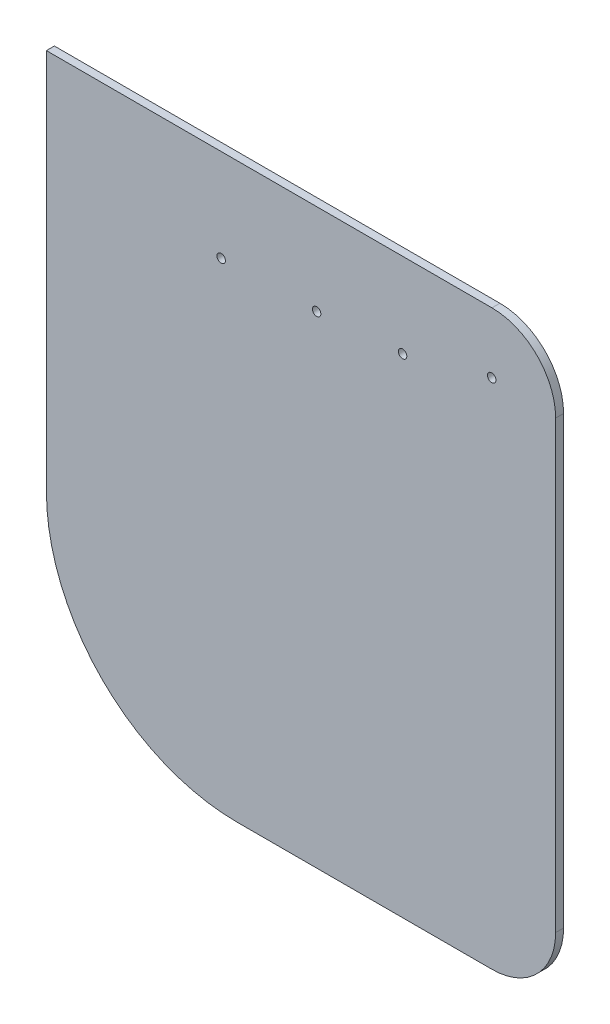
ISO-10303-21;
HEADER;
FILE_DESCRIPTION(('STEP AP214'),'2;1');
FILE_NAME('part.step','',(''),(''),'','','');
FILE_SCHEMA(('AUTOMOTIVE_DESIGN { 1 0 10303 214 1 1 1 1 }'));
ENDSEC;
DATA;
#1=APPLICATION_CONTEXT('core data for automotive mechanical design processes');
#2=APPLICATION_PROTOCOL_DEFINITION('international standard','automotive_design',2000,#1);
#3=PRODUCT_CONTEXT('',#1,'mechanical');
#4=PRODUCT('Part','Part','',(#3));
#5=PRODUCT_RELATED_PRODUCT_CATEGORY('part','',(#4));
#6=PRODUCT_DEFINITION_FORMATION('','',#4);
#7=PRODUCT_DEFINITION_CONTEXT('part definition',#1,'design');
#8=PRODUCT_DEFINITION('design','',#6,#7);
#9=PRODUCT_DEFINITION_SHAPE('','',#8);
#10=(LENGTH_UNIT() NAMED_UNIT(*) SI_UNIT(.MILLI.,.METRE.));
#11=(NAMED_UNIT(*) PLANE_ANGLE_UNIT() SI_UNIT($,.RADIAN.));
#12=(NAMED_UNIT(*) SI_UNIT($,.STERADIAN.) SOLID_ANGLE_UNIT());
#13=UNCERTAINTY_MEASURE_WITH_UNIT(LENGTH_MEASURE(1.E-05),#10,'distance_accuracy_value','');
#14=(GEOMETRIC_REPRESENTATION_CONTEXT(3) GLOBAL_UNCERTAINTY_ASSIGNED_CONTEXT((#13)) GLOBAL_UNIT_ASSIGNED_CONTEXT((#10,
#11,#12)) REPRESENTATION_CONTEXT('',''));
#15=CARTESIAN_POINT('',(0.,0.,0.));
#16=DIRECTION('',(0.,0.,1.));
#17=DIRECTION('',(1.,0.,0.));
#18=AXIS2_PLACEMENT_3D('',#15,#16,#17);
#19=CARTESIAN_POINT('',(-203.2,228.6,6.35));
#20=DIRECTION('',(1.,0.,0.));
#21=DIRECTION('',(0.,1.,0.));
#22=AXIS2_PLACEMENT_3D('',#19,#20,#21);
#23=PLANE('',#22);
#24=DIRECTION('',(0.,-1.,0.));
#25=VECTOR('',#24,1.);
#26=CARTESIAN_POINT('',(-203.2,228.6,0.));
#27=LINE('',#26,#25);
#28=CARTESIAN_POINT('',(-203.2,228.6,0.));
#29=VERTEX_POINT('',#28);
#30=CARTESIAN_POINT('',(-203.2,-76.1999999999989,0.));
#31=VERTEX_POINT('',#30);
#32=EDGE_CURVE('E129',#29,#31,#27,.T.);
#33=ORIENTED_EDGE('',*,*,#32,.T.);
#34=DIRECTION('',(0.,0.,-1.));
#35=VECTOR('',#34,1.);
#36=CARTESIAN_POINT('',(-203.2,-76.1999999999989,6.35));
#37=LINE('',#36,#35);
#38=CARTESIAN_POINT('',(-203.2,-76.1999999999989,6.35));
#39=VERTEX_POINT('',#38);
#40=EDGE_CURVE('E11',#39,#31,#37,.T.);
#41=ORIENTED_EDGE('',*,*,#40,.F.);
#42=DIRECTION('',(0.,-1.,0.));
#43=VECTOR('',#42,1.);
#44=CARTESIAN_POINT('',(-203.2,228.6,6.35));
#45=LINE('',#44,#43);
#46=CARTESIAN_POINT('',(-203.2,228.6,6.35));
#47=VERTEX_POINT('',#46);
#48=EDGE_CURVE('E142',#47,#39,#45,.T.);
#49=ORIENTED_EDGE('',*,*,#48,.F.);
#50=DIRECTION('',(0.,0.,-1.));
#51=VECTOR('',#50,1.);
#52=CARTESIAN_POINT('',(-203.2,228.6,6.35));
#53=LINE('',#52,#51);
#54=EDGE_CURVE('E125',#47,#29,#53,.T.);
#55=ORIENTED_EDGE('',*,*,#54,.T.);
#56=EDGE_LOOP('',(#33,#41,#49,#55));
#57=FACE_BOUND('',#56,.T.);
#58=ADVANCED_FACE('F39',(#57),#23,.F.);
#59=CARTESIAN_POINT('',(-50.8,-76.2,6.35));
#60=DIRECTION('',(0.,0.,-1.));
#61=DIRECTION('',(-1.,0.,0.));
#62=AXIS2_PLACEMENT_3D('',#59,#60,#61);
#63=CYLINDRICAL_SURFACE('',#62,152.4);
#64=CARTESIAN_POINT('',(-50.8,-76.2,0.));
#65=DIRECTION('',(0.,0.,1.));
#66=DIRECTION('',(1.,0.,0.));
#67=AXIS2_PLACEMENT_3D('',#64,#65,#66);
#68=CIRCLE('',#67,152.4);
#69=CARTESIAN_POINT('',(-50.7999999999988,-228.6,0.));
#70=VERTEX_POINT('',#69);
#71=EDGE_CURVE('E132',#31,#70,#68,.T.);
#72=ORIENTED_EDGE('',*,*,#71,.T.);
#73=DIRECTION('',(0.,0.,-1.));
#74=VECTOR('',#73,1.);
#75=CARTESIAN_POINT('',(-50.7999999999988,-228.6,6.35));
#76=LINE('',#75,#74);
#77=CARTESIAN_POINT('',(-50.7999999999988,-228.6,6.35));
#78=VERTEX_POINT('',#77);
#79=EDGE_CURVE('E47',#78,#70,#76,.T.);
#80=ORIENTED_EDGE('',*,*,#79,.F.);
#81=CARTESIAN_POINT('',(-50.8,-76.2,6.35));
#82=DIRECTION('',(0.,0.,1.));
#83=DIRECTION('',(1.,0.,0.));
#84=AXIS2_PLACEMENT_3D('',#81,#82,#83);
#85=CIRCLE('',#84,152.4);
#86=EDGE_CURVE('E95',#39,#78,#85,.T.);
#87=ORIENTED_EDGE('',*,*,#86,.F.);
#88=ORIENTED_EDGE('',*,*,#40,.T.);
#89=EDGE_LOOP('',(#72,#80,#87,#88));
#90=FACE_BOUND('',#89,.T.);
#91=ADVANCED_FACE('F220',(#90),#63,.T.);
#92=CARTESIAN_POINT('',(-50.7999999999988,-228.6,6.35));
#93=DIRECTION('',(0.,1.,0.));
#94=DIRECTION('',(0.,0.,1.));
#95=AXIS2_PLACEMENT_3D('',#92,#93,#94);
#96=PLANE('',#95);
#97=DIRECTION('',(1.,0.,0.));
#98=VECTOR('',#97,1.);
#99=CARTESIAN_POINT('',(-50.7999999999988,-228.6,0.));
#100=LINE('',#99,#98);
#101=CARTESIAN_POINT('',(152.4,-228.6,0.));
#102=VERTEX_POINT('',#101);
#103=EDGE_CURVE('E135',#70,#102,#100,.T.);
#104=ORIENTED_EDGE('',*,*,#103,.T.);
#105=DIRECTION('',(0.,0.,-1.));
#106=VECTOR('',#105,1.);
#107=CARTESIAN_POINT('',(152.4,-228.6,6.35));
#108=LINE('',#107,#106);
#109=CARTESIAN_POINT('',(152.4,-228.6,6.35));
#110=VERTEX_POINT('',#109);
#111=EDGE_CURVE('E146',#110,#102,#108,.T.);
#112=ORIENTED_EDGE('',*,*,#111,.F.);
#113=DIRECTION('',(1.,0.,0.));
#114=VECTOR('',#113,1.);
#115=CARTESIAN_POINT('',(-50.7999999999988,-228.6,6.35));
#116=LINE('',#115,#114);
#117=EDGE_CURVE('E154',#78,#110,#116,.T.);
#118=ORIENTED_EDGE('',*,*,#117,.F.);
#119=ORIENTED_EDGE('',*,*,#79,.T.);
#120=EDGE_LOOP('',(#104,#112,#118,#119));
#121=FACE_BOUND('',#120,.T.);
#122=ADVANCED_FACE('F152',(#121),#96,.F.);
#123=CARTESIAN_POINT('',(152.4,-177.8,6.35));
#124=DIRECTION('',(0.,0.,-1.));
#125=DIRECTION('',(-1.,0.,0.));
#126=AXIS2_PLACEMENT_3D('',#123,#124,#125);
#127=CYLINDRICAL_SURFACE('',#126,50.8);
#128=CARTESIAN_POINT('',(152.4,-177.8,0.));
#129=DIRECTION('',(0.,0.,1.));
#130=DIRECTION('',(1.,0.,0.));
#131=AXIS2_PLACEMENT_3D('',#128,#129,#130);
#132=CIRCLE('',#131,50.8);
#133=CARTESIAN_POINT('',(203.2,-177.8,0.));
#134=VERTEX_POINT('',#133);
#135=EDGE_CURVE('E137',#102,#134,#132,.T.);
#136=ORIENTED_EDGE('',*,*,#135,.T.);
#137=DIRECTION('',(0.,0.,-1.));
#138=VECTOR('',#137,1.);
#139=CARTESIAN_POINT('',(203.2,-177.8,6.35));
#140=LINE('',#139,#138);
#141=CARTESIAN_POINT('',(203.2,-177.8,6.35));
#142=VERTEX_POINT('',#141);
#143=EDGE_CURVE('E120',#142,#134,#140,.T.);
#144=ORIENTED_EDGE('',*,*,#143,.F.);
#145=CARTESIAN_POINT('',(152.4,-177.8,6.35));
#146=DIRECTION('',(0.,0.,1.));
#147=DIRECTION('',(1.,0.,0.));
#148=AXIS2_PLACEMENT_3D('',#145,#146,#147);
#149=CIRCLE('',#148,50.8);
#150=EDGE_CURVE('E111',#110,#142,#149,.T.);
#151=ORIENTED_EDGE('',*,*,#150,.F.);
#152=ORIENTED_EDGE('',*,*,#111,.T.);
#153=EDGE_LOOP('',(#136,#144,#151,#152));
#154=FACE_BOUND('',#153,.T.);
#155=ADVANCED_FACE('F160',(#154),#127,.T.);
#156=CARTESIAN_POINT('',(203.2,177.8,6.35));
#157=DIRECTION('',(-1.,0.,0.));
#158=DIRECTION('',(0.,-1.,0.));
#159=AXIS2_PLACEMENT_3D('',#156,#157,#158);
#160=PLANE('',#159);
#161=DIRECTION('',(0.,1.,0.));
#162=VECTOR('',#161,1.);
#163=CARTESIAN_POINT('',(203.2,177.8,0.));
#164=LINE('',#163,#162);
#165=CARTESIAN_POINT('',(203.2,177.8,0.));
#166=VERTEX_POINT('',#165);
#167=EDGE_CURVE('E119',#134,#166,#164,.T.);
#168=ORIENTED_EDGE('',*,*,#167,.T.);
#169=DIRECTION('',(0.,0.,-1.));
#170=VECTOR('',#169,1.);
#171=CARTESIAN_POINT('',(203.2,177.8,6.35));
#172=LINE('',#171,#170);
#173=CARTESIAN_POINT('',(203.2,177.8,6.35));
#174=VERTEX_POINT('',#173);
#175=EDGE_CURVE('E116',#174,#166,#172,.T.);
#176=ORIENTED_EDGE('',*,*,#175,.F.);
#177=DIRECTION('',(0.,1.,0.));
#178=VECTOR('',#177,1.);
#179=CARTESIAN_POINT('',(203.2,177.8,6.35));
#180=LINE('',#179,#178);
#181=EDGE_CURVE('E105',#142,#174,#180,.T.);
#182=ORIENTED_EDGE('',*,*,#181,.F.);
#183=ORIENTED_EDGE('',*,*,#143,.T.);
#184=EDGE_LOOP('',(#168,#176,#182,#183));
#185=FACE_BOUND('',#184,.T.);
#186=ADVANCED_FACE('F117',(#185),#160,.F.);
#187=CARTESIAN_POINT('',(152.4,177.8,6.35));
#188=DIRECTION('',(0.,0.,-1.));
#189=DIRECTION('',(-1.,0.,0.));
#190=AXIS2_PLACEMENT_3D('',#187,#188,#189);
#191=CYLINDRICAL_SURFACE('',#190,50.8);
#192=CARTESIAN_POINT('',(152.4,177.8,0.));
#193=DIRECTION('',(0.,0.,1.));
#194=DIRECTION('',(1.,0.,0.));
#195=AXIS2_PLACEMENT_3D('',#192,#193,#194);
#196=CIRCLE('',#195,50.8);
#197=CARTESIAN_POINT('',(152.4,228.6,0.));
#198=VERTEX_POINT('',#197);
#199=EDGE_CURVE('E81',#166,#198,#196,.T.);
#200=ORIENTED_EDGE('',*,*,#199,.T.);
#201=DIRECTION('',(0.,0.,-1.));
#202=VECTOR('',#201,1.);
#203=CARTESIAN_POINT('',(152.4,228.6,6.35));
#204=LINE('',#203,#202);
#205=CARTESIAN_POINT('',(152.4,228.6,6.35));
#206=VERTEX_POINT('',#205);
#207=EDGE_CURVE('E121',#206,#198,#204,.T.);
#208=ORIENTED_EDGE('',*,*,#207,.F.);
#209=CARTESIAN_POINT('',(152.4,177.8,6.35));
#210=DIRECTION('',(0.,0.,1.));
#211=DIRECTION('',(1.,0.,0.));
#212=AXIS2_PLACEMENT_3D('',#209,#210,#211);
#213=CIRCLE('',#212,50.8);
#214=EDGE_CURVE('E109',#174,#206,#213,.T.);
#215=ORIENTED_EDGE('',*,*,#214,.F.);
#216=ORIENTED_EDGE('',*,*,#175,.T.);
#217=EDGE_LOOP('',(#200,#208,#215,#216));
#218=FACE_BOUND('',#217,.T.);
#219=ADVANCED_FACE('F123',(#218),#191,.T.);
#220=CARTESIAN_POINT('',(-203.2,228.6,6.35));
#221=DIRECTION('',(0.,-1.,0.));
#222=DIRECTION('',(0.,0.,-1.));
#223=AXIS2_PLACEMENT_3D('',#220,#221,#222);
#224=PLANE('',#223);
#225=DIRECTION('',(-1.,0.,0.));
#226=VECTOR('',#225,1.);
#227=CARTESIAN_POINT('',(-203.2,228.6,0.));
#228=LINE('',#227,#226);
#229=EDGE_CURVE('E87',#198,#29,#228,.T.);
#230=ORIENTED_EDGE('',*,*,#229,.T.);
#231=ORIENTED_EDGE('',*,*,#54,.F.);
#232=DIRECTION('',(-1.,0.,0.));
#233=VECTOR('',#232,1.);
#234=CARTESIAN_POINT('',(-203.2,228.6,6.35));
#235=LINE('',#234,#233);
#236=EDGE_CURVE('E55',#206,#47,#235,.T.);
#237=ORIENTED_EDGE('',*,*,#236,.F.);
#238=ORIENTED_EDGE('',*,*,#207,.T.);
#239=EDGE_LOOP('',(#230,#231,#237,#238));
#240=FACE_BOUND('',#239,.T.);
#241=ADVANCED_FACE('F227',(#240),#224,.F.);
#242=CARTESIAN_POINT('',(-50.8,-76.2,6.35));
#243=DIRECTION('',(0.,0.,1.));
#244=DIRECTION('',(1.,0.,0.));
#245=AXIS2_PLACEMENT_3D('',#242,#243,#244);
#246=PLANE('',#245);
#247=CARTESIAN_POINT('',(152.16956229562,180.205935018937,6.35));
#248=DIRECTION('',(0.,0.,-1.));
#249=DIRECTION('',(-1.,0.,0.));
#250=AXIS2_PLACEMENT_3D('',#247,#248,#249);
#251=CIRCLE('',#250,3.37819999999999);
#252=CARTESIAN_POINT('',(148.79136229562,180.205935018937,6.35));
#253=VERTEX_POINT('',#252);
#254=EDGE_CURVE('E133',#253,#253,#251,.T.);
#255=ORIENTED_EDGE('',*,*,#254,.T.);
#256=EDGE_LOOP('',(#255));
#257=FACE_BOUND('',#256,.T.);
#258=CARTESIAN_POINT('',(12.4695622956204,156.075935463149,6.35));
#259=DIRECTION('',(0.,0.,-1.));
#260=DIRECTION('',(-1.,0.,0.));
#261=AXIS2_PLACEMENT_3D('',#258,#259,#260);
#262=CIRCLE('',#261,3.3782);
#263=CARTESIAN_POINT('',(9.09136229562039,156.075935463149,6.35));
#264=VERTEX_POINT('',#263);
#265=EDGE_CURVE('E179',#264,#264,#262,.T.);
#266=ORIENTED_EDGE('',*,*,#265,.T.);
#267=EDGE_LOOP('',(#266));
#268=FACE_BOUND('',#267,.T.);
#269=CARTESIAN_POINT('',(-63.7304377043796,154.805935463149,6.35));
#270=DIRECTION('',(0.,0.,-1.));
#271=DIRECTION('',(-1.,0.,0.));
#272=AXIS2_PLACEMENT_3D('',#269,#270,#271);
#273=CIRCLE('',#272,3.37819999999999);
#274=CARTESIAN_POINT('',(-67.1086377043796,154.805935463149,6.35));
#275=VERTEX_POINT('',#274);
#276=EDGE_CURVE('E165',#275,#275,#273,.T.);
#277=ORIENTED_EDGE('',*,*,#276,.T.);
#278=EDGE_LOOP('',(#277));
#279=FACE_BOUND('',#278,.T.);
#280=CARTESIAN_POINT('',(81.0495622956204,161.155935463149,6.35));
#281=DIRECTION('',(0.,0.,-1.));
#282=DIRECTION('',(-1.,0.,0.));
#283=AXIS2_PLACEMENT_3D('',#280,#281,#282);
#284=CIRCLE('',#283,3.37819999999999);
#285=CARTESIAN_POINT('',(77.6713622956204,161.155935463149,6.35));
#286=VERTEX_POINT('',#285);
#287=EDGE_CURVE('E172',#286,#286,#284,.T.);
#288=ORIENTED_EDGE('',*,*,#287,.T.);
#289=EDGE_LOOP('',(#288));
#290=FACE_BOUND('',#289,.T.);
#291=ORIENTED_EDGE('',*,*,#48,.T.);
#292=ORIENTED_EDGE('',*,*,#86,.T.);
#293=ORIENTED_EDGE('',*,*,#117,.T.);
#294=ORIENTED_EDGE('',*,*,#150,.T.);
#295=ORIENTED_EDGE('',*,*,#181,.T.);
#296=ORIENTED_EDGE('',*,*,#214,.T.);
#297=ORIENTED_EDGE('',*,*,#236,.T.);
#298=EDGE_LOOP('',(#291,#292,#293,#294,#295,#296,#297));
#299=FACE_BOUND('',#298,.T.);
#300=ADVANCED_FACE('F107',(#257,#268,#279,#290,#299),#246,.T.);
#301=CARTESIAN_POINT('',(-50.8,-76.2,0.));
#302=DIRECTION('',(0.,0.,1.));
#303=DIRECTION('',(1.,0.,0.));
#304=AXIS2_PLACEMENT_3D('',#301,#302,#303);
#305=PLANE('',#304);
#306=CARTESIAN_POINT('',(152.16956229562,180.205935018937,0.));
#307=DIRECTION('',(0.,0.,-1.));
#308=DIRECTION('',(-1.,0.,0.));
#309=AXIS2_PLACEMENT_3D('',#306,#307,#308);
#310=CIRCLE('',#309,3.37819999999999);
#311=CARTESIAN_POINT('',(148.79136229562,180.205935018937,0.));
#312=VERTEX_POINT('',#311);
#313=EDGE_CURVE('E178',#312,#312,#310,.T.);
#314=ORIENTED_EDGE('',*,*,#313,.F.);
#315=EDGE_LOOP('',(#314));
#316=FACE_BOUND('',#315,.T.);
#317=CARTESIAN_POINT('',(12.4695622956204,156.075935463149,0.));
#318=DIRECTION('',(0.,0.,-1.));
#319=DIRECTION('',(-1.,0.,0.));
#320=AXIS2_PLACEMENT_3D('',#317,#318,#319);
#321=CIRCLE('',#320,3.3782);
#322=CARTESIAN_POINT('',(9.09136229562039,156.075935463149,0.));
#323=VERTEX_POINT('',#322);
#324=EDGE_CURVE('E169',#323,#323,#321,.T.);
#325=ORIENTED_EDGE('',*,*,#324,.F.);
#326=EDGE_LOOP('',(#325));
#327=FACE_BOUND('',#326,.T.);
#328=CARTESIAN_POINT('',(-63.7304377043796,154.805935463149,0.));
#329=DIRECTION('',(0.,0.,-1.));
#330=DIRECTION('',(-1.,0.,0.));
#331=AXIS2_PLACEMENT_3D('',#328,#329,#330);
#332=CIRCLE('',#331,3.37819999999999);
#333=CARTESIAN_POINT('',(-67.1086377043796,154.805935463149,0.));
#334=VERTEX_POINT('',#333);
#335=EDGE_CURVE('E168',#334,#334,#332,.T.);
#336=ORIENTED_EDGE('',*,*,#335,.F.);
#337=EDGE_LOOP('',(#336));
#338=FACE_BOUND('',#337,.T.);
#339=CARTESIAN_POINT('',(81.0495622956204,161.155935463149,0.));
#340=DIRECTION('',(0.,0.,-1.));
#341=DIRECTION('',(-1.,0.,0.));
#342=AXIS2_PLACEMENT_3D('',#339,#340,#341);
#343=CIRCLE('',#342,3.37819999999999);
#344=CARTESIAN_POINT('',(77.6713622956204,161.155935463149,0.));
#345=VERTEX_POINT('',#344);
#346=EDGE_CURVE('E175',#345,#345,#343,.T.);
#347=ORIENTED_EDGE('',*,*,#346,.F.);
#348=EDGE_LOOP('',(#347));
#349=FACE_BOUND('',#348,.T.);
#350=ORIENTED_EDGE('',*,*,#32,.F.);
#351=ORIENTED_EDGE('',*,*,#229,.F.);
#352=ORIENTED_EDGE('',*,*,#199,.F.);
#353=ORIENTED_EDGE('',*,*,#167,.F.);
#354=ORIENTED_EDGE('',*,*,#135,.F.);
#355=ORIENTED_EDGE('',*,*,#103,.F.);
#356=ORIENTED_EDGE('',*,*,#71,.F.);
#357=EDGE_LOOP('',(#350,#351,#352,#353,#354,#355,#356));
#358=FACE_BOUND('',#357,.T.);
#359=ADVANCED_FACE('F158',(#316,#327,#338,#349,#358),#305,.F.);
#360=CARTESIAN_POINT('',(81.0495622956204,161.155935463149,6.35));
#361=DIRECTION('',(0.,0.,-1.));
#362=DIRECTION('',(-1.,0.,0.));
#363=AXIS2_PLACEMENT_3D('',#360,#361,#362);
#364=CYLINDRICAL_SURFACE('',#363,3.37819999999999);
#365=ORIENTED_EDGE('',*,*,#287,.F.);
#366=EDGE_LOOP('',(#365));
#367=FACE_BOUND('',#366,.T.);
#368=ORIENTED_EDGE('',*,*,#346,.T.);
#369=EDGE_LOOP('',(#368));
#370=FACE_BOUND('',#369,.T.);
#371=ADVANCED_FACE('F200',(#367,#370),#364,.F.);
#372=CARTESIAN_POINT('',(-63.7304377043796,154.805935463149,6.35));
#373=DIRECTION('',(0.,0.,-1.));
#374=DIRECTION('',(-1.,0.,0.));
#375=AXIS2_PLACEMENT_3D('',#372,#373,#374);
#376=CYLINDRICAL_SURFACE('',#375,3.37819999999999);
#377=ORIENTED_EDGE('',*,*,#276,.F.);
#378=EDGE_LOOP('',(#377));
#379=FACE_BOUND('',#378,.T.);
#380=ORIENTED_EDGE('',*,*,#335,.T.);
#381=EDGE_LOOP('',(#380));
#382=FACE_BOUND('',#381,.T.);
#383=ADVANCED_FACE('F209',(#379,#382),#376,.F.);
#384=CARTESIAN_POINT('',(12.4695622956204,156.075935463149,6.35));
#385=DIRECTION('',(0.,0.,-1.));
#386=DIRECTION('',(-1.,0.,0.));
#387=AXIS2_PLACEMENT_3D('',#384,#385,#386);
#388=CYLINDRICAL_SURFACE('',#387,3.3782);
#389=ORIENTED_EDGE('',*,*,#265,.F.);
#390=EDGE_LOOP('',(#389));
#391=FACE_BOUND('',#390,.T.);
#392=ORIENTED_EDGE('',*,*,#324,.T.);
#393=EDGE_LOOP('',(#392));
#394=FACE_BOUND('',#393,.T.);
#395=ADVANCED_FACE('F194',(#391,#394),#388,.F.);
#396=CARTESIAN_POINT('',(152.16956229562,180.205935018937,6.35));
#397=DIRECTION('',(0.,0.,-1.));
#398=DIRECTION('',(-1.,0.,0.));
#399=AXIS2_PLACEMENT_3D('',#396,#397,#398);
#400=CYLINDRICAL_SURFACE('',#399,3.37819999999999);
#401=ORIENTED_EDGE('',*,*,#254,.F.);
#402=EDGE_LOOP('',(#401));
#403=FACE_BOUND('',#402,.T.);
#404=ORIENTED_EDGE('',*,*,#313,.T.);
#405=EDGE_LOOP('',(#404));
#406=FACE_BOUND('',#405,.T.);
#407=ADVANCED_FACE('F191',(#403,#406),#400,.F.);
#408=CLOSED_SHELL('',(#58,#91,#122,#155,#186,#219,#241,#300,#359,#371,#383,#395,#407));
#409=MANIFOLD_SOLID_BREP('B2',#408);
#410=ADVANCED_BREP_SHAPE_REPRESENTATION('',(#18,#409),#14);
#411=SHAPE_DEFINITION_REPRESENTATION(#9,#410);
ENDSEC;
END-ISO-10303-21;
